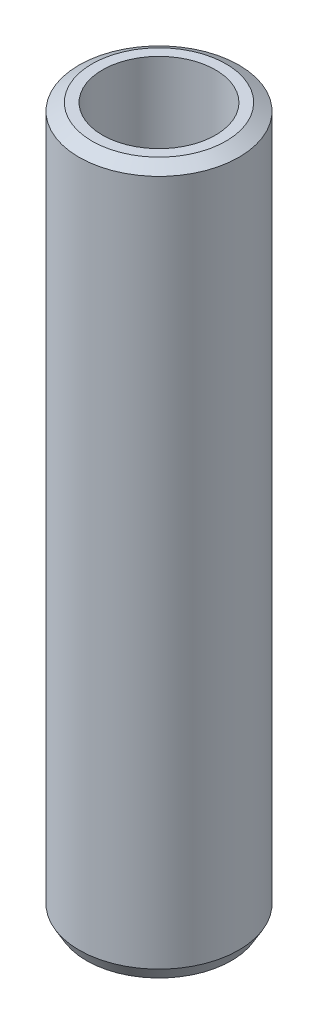
ISO-10303-21;
HEADER;
FILE_DESCRIPTION(('STEP AP214'),'2;1');
FILE_NAME('part.step','',(''),(''),'','','');
FILE_SCHEMA(('AUTOMOTIVE_DESIGN { 1 0 10303 214 1 1 1 1 }'));
ENDSEC;
DATA;
#1=APPLICATION_CONTEXT('core data for automotive mechanical design processes');
#2=APPLICATION_PROTOCOL_DEFINITION('international standard','automotive_design',2000,#1);
#3=PRODUCT_CONTEXT('',#1,'mechanical');
#4=PRODUCT('Part','Part','',(#3));
#5=PRODUCT_RELATED_PRODUCT_CATEGORY('part','',(#4));
#6=PRODUCT_DEFINITION_FORMATION('','',#4);
#7=PRODUCT_DEFINITION_CONTEXT('part definition',#1,'design');
#8=PRODUCT_DEFINITION('design','',#6,#7);
#9=PRODUCT_DEFINITION_SHAPE('','',#8);
#10=(LENGTH_UNIT() NAMED_UNIT(*) SI_UNIT(.MILLI.,.METRE.));
#11=(NAMED_UNIT(*) PLANE_ANGLE_UNIT() SI_UNIT($,.RADIAN.));
#12=(NAMED_UNIT(*) SI_UNIT($,.STERADIAN.) SOLID_ANGLE_UNIT());
#13=UNCERTAINTY_MEASURE_WITH_UNIT(LENGTH_MEASURE(1.E-05),#10,'distance_accuracy_value','');
#14=(GEOMETRIC_REPRESENTATION_CONTEXT(3) GLOBAL_UNCERTAINTY_ASSIGNED_CONTEXT((#13)) GLOBAL_UNIT_ASSIGNED_CONTEXT((#10,
#11,#12)) REPRESENTATION_CONTEXT('',''));
#15=CARTESIAN_POINT('',(0.,0.,0.));
#16=DIRECTION('',(0.,0.,1.));
#17=DIRECTION('',(1.,0.,0.));
#18=AXIS2_PLACEMENT_3D('',#15,#16,#17);
#19=CARTESIAN_POINT('',(0.,464.351984855082,0.));
#20=DIRECTION('',(0.,-1.,0.));
#21=DIRECTION('',(0.,0.,-1.));
#22=AXIS2_PLACEMENT_3D('',#19,#20,#21);
#23=CYLINDRICAL_SURFACE('',#22,52.5);
#24=CARTESIAN_POINT('',(0.,459.435816473445,0.));
#25=DIRECTION('',(0.,1.,0.));
#26=DIRECTION('',(0.,0.,1.));
#27=AXIS2_PLACEMENT_3D('',#24,#25,#26);
#28=CIRCLE('',#27,52.5);
#29=CARTESIAN_POINT('',(0.,459.435816473445,52.5));
#30=VERTEX_POINT('',#29);
#31=EDGE_CURVE('E50',#30,#30,#28,.F.);
#32=ORIENTED_EDGE('',*,*,#31,.T.);
#33=EDGE_LOOP('',(#32));
#34=FACE_BOUND('',#33,.T.);
#35=CARTESIAN_POINT('',(0.,8.51505341555875,0.));
#36=DIRECTION('',(0.,1.,0.));
#37=DIRECTION('',(0.,0.,1.));
#38=AXIS2_PLACEMENT_3D('',#35,#36,#37);
#39=CIRCLE('',#38,52.5);
#40=CARTESIAN_POINT('',(0.,8.51505341555875,52.5));
#41=VERTEX_POINT('',#40);
#42=EDGE_CURVE('E51',#41,#41,#39,.T.);
#43=ORIENTED_EDGE('',*,*,#42,.T.);
#44=EDGE_LOOP('',(#43));
#45=FACE_BOUND('',#44,.T.);
#46=ADVANCED_FACE('F39',(#34,#45),#23,.T.);
#47=CARTESIAN_POINT('',(0.,464.351984855082,0.));
#48=DIRECTION('',(0.,1.,0.));
#49=DIRECTION('',(0.,0.,1.));
#50=AXIS2_PLACEMENT_3D('',#47,#48,#49);
#51=PLANE('',#50);
#52=CARTESIAN_POINT('',(0.,464.351984855082,0.));
#53=DIRECTION('',(0.,1.,0.));
#54=DIRECTION('',(0.,0.,1.));
#55=AXIS2_PLACEMENT_3D('',#52,#53,#54);
#56=CIRCLE('',#55,43.9849465844413);
#57=CARTESIAN_POINT('',(0.,464.351984855082,43.9849465844413));
#58=VERTEX_POINT('',#57);
#59=EDGE_CURVE('E54',#58,#58,#56,.T.);
#60=ORIENTED_EDGE('',*,*,#59,.T.);
#61=EDGE_LOOP('',(#60));
#62=FACE_BOUND('',#61,.T.);
#63=CARTESIAN_POINT('',(0.,464.351984855082,0.));
#64=DIRECTION('',(0.,1.,0.));
#65=DIRECTION('',(0.,0.,1.));
#66=AXIS2_PLACEMENT_3D('',#63,#64,#65);
#67=CIRCLE('',#66,37.145115566609);
#68=CARTESIAN_POINT('',(0.,464.351984855082,37.145115566609));
#69=VERTEX_POINT('',#68);
#70=EDGE_CURVE('E58',#69,#69,#67,.T.);
#71=ORIENTED_EDGE('',*,*,#70,.F.);
#72=EDGE_LOOP('',(#71));
#73=FACE_BOUND('',#72,.T.);
#74=ADVANCED_FACE('F69',(#62,#73),#51,.T.);
#75=CARTESIAN_POINT('',(0.,0.,0.));
#76=DIRECTION('',(0.,1.,0.));
#77=DIRECTION('',(0.,0.,1.));
#78=AXIS2_PLACEMENT_3D('',#75,#76,#77);
#79=PLANE('',#78);
#80=CARTESIAN_POINT('',(0.,0.,0.));
#81=DIRECTION('',(0.,1.,0.));
#82=DIRECTION('',(0.,0.,1.));
#83=AXIS2_PLACEMENT_3D('',#80,#81,#82);
#84=CIRCLE('',#83,47.5838316183631);
#85=CARTESIAN_POINT('',(0.,0.,47.5838316183631));
#86=VERTEX_POINT('',#85);
#87=EDGE_CURVE('E10',#86,#86,#84,.F.);
#88=ORIENTED_EDGE('',*,*,#87,.T.);
#89=EDGE_LOOP('',(#88));
#90=FACE_BOUND('',#89,.T.);
#91=CARTESIAN_POINT('',(0.,0.,0.));
#92=DIRECTION('',(0.,1.,0.));
#93=DIRECTION('',(0.,0.,1.));
#94=AXIS2_PLACEMENT_3D('',#91,#92,#93);
#95=CIRCLE('',#94,37.145115566609);
#96=CARTESIAN_POINT('',(0.,0.,37.145115566609));
#97=VERTEX_POINT('',#96);
#98=EDGE_CURVE('E63',#97,#97,#95,.T.);
#99=ORIENTED_EDGE('',*,*,#98,.T.);
#100=EDGE_LOOP('',(#99));
#101=FACE_BOUND('',#100,.T.);
#102=ADVANCED_FACE('F75',(#90,#101),#79,.F.);
#103=CARTESIAN_POINT('',(0.,464.351984855082,0.));
#104=DIRECTION('',(0.,-1.,0.));
#105=DIRECTION('',(0.,0.,-1.));
#106=AXIS2_PLACEMENT_3D('',#103,#104,#105);
#107=CYLINDRICAL_SURFACE('',#106,37.145115566609);
#108=ORIENTED_EDGE('',*,*,#70,.T.);
#109=EDGE_LOOP('',(#108));
#110=FACE_BOUND('',#109,.T.);
#111=ORIENTED_EDGE('',*,*,#98,.F.);
#112=EDGE_LOOP('',(#111));
#113=FACE_BOUND('',#112,.T.);
#114=ADVANCED_FACE('F70',(#110,#113),#107,.F.);
#115=CARTESIAN_POINT('',(0.,464.351984855082,0.));
#116=DIRECTION('',(0.,-1.,0.));
#117=DIRECTION('',(0.,0.,-1.));
#118=AXIS2_PLACEMENT_3D('',#115,#116,#117);
#119=CONICAL_SURFACE('',#118,43.9849465844413,1.0471975511966);
#120=ORIENTED_EDGE('',*,*,#31,.F.);
#121=EDGE_LOOP('',(#120));
#122=FACE_BOUND('',#121,.T.);
#123=ORIENTED_EDGE('',*,*,#59,.F.);
#124=EDGE_LOOP('',(#123));
#125=FACE_BOUND('',#124,.T.);
#126=ADVANCED_FACE('F81',(#122,#125),#119,.T.);
#127=CARTESIAN_POINT('',(0.,8.51505341555875,0.));
#128=DIRECTION('',(0.,1.,0.));
#129=DIRECTION('',(0.,0.,1.));
#130=AXIS2_PLACEMENT_3D('',#127,#128,#129);
#131=CONICAL_SURFACE('',#130,52.5,0.523598775598302);
#132=ORIENTED_EDGE('',*,*,#87,.F.);
#133=EDGE_LOOP('',(#132));
#134=FACE_BOUND('',#133,.T.);
#135=ORIENTED_EDGE('',*,*,#42,.F.);
#136=EDGE_LOOP('',(#135));
#137=FACE_BOUND('',#136,.T.);
#138=ADVANCED_FACE('F45',(#134,#137),#131,.T.);
#139=CLOSED_SHELL('',(#46,#74,#102,#114,#126,#138));
#140=MANIFOLD_SOLID_BREP('B2',#139);
#141=ADVANCED_BREP_SHAPE_REPRESENTATION('',(#18,#140),#14);
#142=SHAPE_DEFINITION_REPRESENTATION(#9,#141);
ENDSEC;
END-ISO-10303-21;
